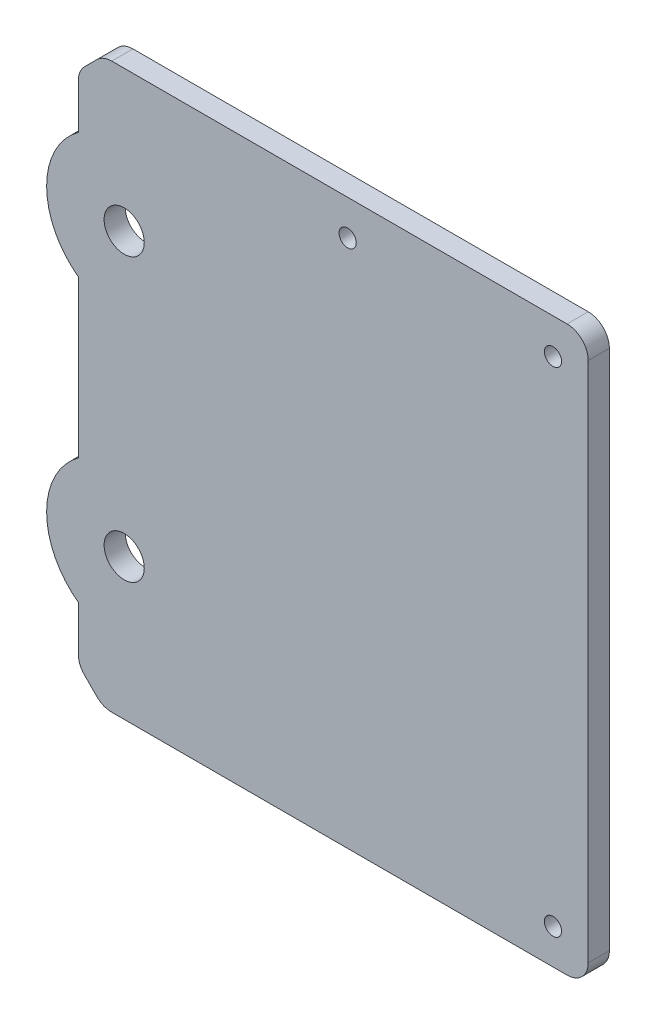
ISO-10303-21;
HEADER;
FILE_DESCRIPTION(('STEP AP214'),'2;1');
FILE_NAME('part.step','',(''),(''),'','','');
FILE_SCHEMA(('AUTOMOTIVE_DESIGN { 1 0 10303 214 1 1 1 1 }'));
ENDSEC;
DATA;
#1=APPLICATION_CONTEXT('core data for automotive mechanical design processes');
#2=APPLICATION_PROTOCOL_DEFINITION('international standard','automotive_design',2000,#1);
#3=PRODUCT_CONTEXT('',#1,'mechanical');
#4=PRODUCT('Part','Part','',(#3));
#5=PRODUCT_RELATED_PRODUCT_CATEGORY('part','',(#4));
#6=PRODUCT_DEFINITION_FORMATION('','',#4);
#7=PRODUCT_DEFINITION_CONTEXT('part definition',#1,'design');
#8=PRODUCT_DEFINITION('design','',#6,#7);
#9=PRODUCT_DEFINITION_SHAPE('','',#8);
#10=(LENGTH_UNIT() NAMED_UNIT(*) SI_UNIT(.MILLI.,.METRE.));
#11=(NAMED_UNIT(*) PLANE_ANGLE_UNIT() SI_UNIT($,.RADIAN.));
#12=(NAMED_UNIT(*) SI_UNIT($,.STERADIAN.) SOLID_ANGLE_UNIT());
#13=UNCERTAINTY_MEASURE_WITH_UNIT(LENGTH_MEASURE(1.E-05),#10,'distance_accuracy_value','');
#14=(GEOMETRIC_REPRESENTATION_CONTEXT(3) GLOBAL_UNCERTAINTY_ASSIGNED_CONTEXT((#13)) GLOBAL_UNIT_ASSIGNED_CONTEXT((#10,
#11,#12)) REPRESENTATION_CONTEXT('',''));
#15=CARTESIAN_POINT('',(0.,0.,0.));
#16=DIRECTION('',(0.,0.,1.));
#17=DIRECTION('',(1.,0.,0.));
#18=AXIS2_PLACEMENT_3D('',#15,#16,#17);
#19=CARTESIAN_POINT('',(-29.105845183392,0.,3.));
#20=DIRECTION('',(1.,0.,0.));
#21=DIRECTION('',(0.,0.,-1.));
#22=AXIS2_PLACEMENT_3D('',#19,#20,#21);
#23=PLANE('',#22);
#24=DIRECTION('',(0.,-1.,0.));
#25=VECTOR('',#24,1.);
#26=CARTESIAN_POINT('',(-29.105845183392,0.,0.));
#27=LINE('',#26,#25);
#28=CARTESIAN_POINT('',(-29.105845183392,11.1258803253506,0.));
#29=VERTEX_POINT('',#28);
#30=CARTESIAN_POINT('',(-29.105845183392,-11.1258803253506,0.));
#31=VERTEX_POINT('',#30);
#32=EDGE_CURVE('E159',#29,#31,#27,.T.);
#33=ORIENTED_EDGE('',*,*,#32,.T.);
#34=DIRECTION('',(0.,0.,1.));
#35=VECTOR('',#34,1.);
#36=CARTESIAN_POINT('',(-29.105845183392,-11.1258803253506,-18.3098334236006));
#37=LINE('',#36,#35);
#38=CARTESIAN_POINT('',(-29.105845183392,-11.1258803253506,3.));
#39=VERTEX_POINT('',#38);
#40=EDGE_CURVE('E60',#31,#39,#37,.T.);
#41=ORIENTED_EDGE('',*,*,#40,.T.);
#42=DIRECTION('',(0.,-1.,0.));
#43=VECTOR('',#42,1.);
#44=CARTESIAN_POINT('',(-29.105845183392,0.,3.));
#45=LINE('',#44,#43);
#46=CARTESIAN_POINT('',(-29.105845183392,11.1258803253506,3.));
#47=VERTEX_POINT('',#46);
#48=EDGE_CURVE('E224',#47,#39,#45,.T.);
#49=ORIENTED_EDGE('',*,*,#48,.F.);
#50=DIRECTION('',(0.,0.,1.));
#51=VECTOR('',#50,1.);
#52=CARTESIAN_POINT('',(-29.105845183392,11.1258803253506,-18.3098334236006));
#53=LINE('',#52,#51);
#54=EDGE_CURVE('E174',#29,#47,#53,.T.);
#55=ORIENTED_EDGE('',*,*,#54,.F.);
#56=EDGE_LOOP('',(#33,#41,#49,#55));
#57=FACE_BOUND('',#56,.T.);
#58=ADVANCED_FACE('F37',(#57),#23,.F.);
#59=CARTESIAN_POINT('',(-29.105845183392,35.2573593128807,0.));
#60=VERTEX_POINT('',#59);
#61=CARTESIAN_POINT('',(-29.105845183392,28.8741196746494,0.));
#62=VERTEX_POINT('',#61);
#63=EDGE_CURVE('E162',#60,#62,#27,.T.);
#64=ORIENTED_EDGE('',*,*,#63,.T.);
#65=DIRECTION('',(0.,0.,1.));
#66=VECTOR('',#65,1.);
#67=CARTESIAN_POINT('',(-29.105845183392,28.8741196746494,-18.3098334236006));
#68=LINE('',#67,#66);
#69=CARTESIAN_POINT('',(-29.105845183392,28.8741196746494,3.));
#70=VERTEX_POINT('',#69);
#71=EDGE_CURVE('E182',#62,#70,#68,.T.);
#72=ORIENTED_EDGE('',*,*,#71,.T.);
#73=CARTESIAN_POINT('',(-29.105845183392,35.2573593128807,3.));
#74=VERTEX_POINT('',#73);
#75=EDGE_CURVE('E220',#74,#70,#45,.T.);
#76=ORIENTED_EDGE('',*,*,#75,.F.);
#77=DIRECTION('',(0.,0.,-1.));
#78=VECTOR('',#77,1.);
#79=CARTESIAN_POINT('',(-29.105845183392,35.2573593128807,0.));
#80=LINE('',#79,#78);
#81=EDGE_CURVE('E279',#74,#60,#80,.T.);
#82=ORIENTED_EDGE('',*,*,#81,.T.);
#83=EDGE_LOOP('',(#64,#72,#76,#82));
#84=FACE_BOUND('',#83,.T.);
#85=ADVANCED_FACE('F345',(#84),#23,.F.);
#86=CARTESIAN_POINT('',(0.,40.,3.));
#87=DIRECTION('',(0.,1.,0.));
#88=DIRECTION('',(0.,0.,1.));
#89=AXIS2_PLACEMENT_3D('',#86,#87,#88);
#90=PLANE('',#89);
#91=DIRECTION('',(1.,0.,0.));
#92=VECTOR('',#91,1.);
#93=CARTESIAN_POINT('',(0.,40.,0.));
#94=LINE('',#93,#92);
#95=CARTESIAN_POINT('',(-24.3632044962727,40.,0.));
#96=VERTEX_POINT('',#95);
#97=CARTESIAN_POINT('',(40.224154816608,40.,0.));
#98=VERTEX_POINT('',#97);
#99=EDGE_CURVE('E160',#96,#98,#94,.T.);
#100=ORIENTED_EDGE('',*,*,#99,.F.);
#101=DIRECTION('',(0.,0.,1.));
#102=VECTOR('',#101,1.);
#103=CARTESIAN_POINT('',(-24.3632044962727,40.,3.));
#104=LINE('',#103,#102);
#105=CARTESIAN_POINT('',(-24.3632044962727,40.,3.));
#106=VERTEX_POINT('',#105);
#107=EDGE_CURVE('E291',#96,#106,#104,.T.);
#108=ORIENTED_EDGE('',*,*,#107,.T.);
#109=DIRECTION('',(1.,0.,0.));
#110=VECTOR('',#109,1.);
#111=CARTESIAN_POINT('',(0.,40.,3.));
#112=LINE('',#111,#110);
#113=CARTESIAN_POINT('',(40.224154816608,40.,3.));
#114=VERTEX_POINT('',#113);
#115=EDGE_CURVE('E216',#106,#114,#112,.T.);
#116=ORIENTED_EDGE('',*,*,#115,.T.);
#117=DIRECTION('',(0.,0.,-1.));
#118=VECTOR('',#117,1.);
#119=CARTESIAN_POINT('',(40.224154816608,40.,3.));
#120=LINE('',#119,#118);
#121=EDGE_CURVE('E288',#114,#98,#120,.T.);
#122=ORIENTED_EDGE('',*,*,#121,.T.);
#123=EDGE_LOOP('',(#100,#108,#116,#122));
#124=FACE_BOUND('',#123,.T.);
#125=ADVANCED_FACE('F309',(#124),#90,.T.);
#126=CARTESIAN_POINT('',(-29.105845183392,-28.8741196746494,3.));
#127=VERTEX_POINT('',#126);
#128=CARTESIAN_POINT('',(-29.105845183392,-35.2573593128807,3.));
#129=VERTEX_POINT('',#128);
#130=EDGE_CURVE('E52',#127,#129,#45,.T.);
#131=ORIENTED_EDGE('',*,*,#130,.F.);
#132=DIRECTION('',(0.,0.,1.));
#133=VECTOR('',#132,1.);
#134=CARTESIAN_POINT('',(-29.105845183392,-28.8741196746494,-18.3098334236006));
#135=LINE('',#134,#133);
#136=CARTESIAN_POINT('',(-29.105845183392,-28.8741196746494,0.));
#137=VERTEX_POINT('',#136);
#138=EDGE_CURVE('E163',#137,#127,#135,.T.);
#139=ORIENTED_EDGE('',*,*,#138,.F.);
#140=CARTESIAN_POINT('',(-29.105845183392,-35.2573593128807,0.));
#141=VERTEX_POINT('',#140);
#142=EDGE_CURVE('E150',#137,#141,#27,.T.);
#143=ORIENTED_EDGE('',*,*,#142,.T.);
#144=DIRECTION('',(0.,0.,1.));
#145=VECTOR('',#144,1.);
#146=CARTESIAN_POINT('',(-29.105845183392,-35.2573593128807,3.));
#147=LINE('',#146,#145);
#148=EDGE_CURVE('E282',#141,#129,#147,.T.);
#149=ORIENTED_EDGE('',*,*,#148,.T.);
#150=EDGE_LOOP('',(#131,#139,#143,#149));
#151=FACE_BOUND('',#150,.T.);
#152=ADVANCED_FACE('F164',(#151),#23,.F.);
#153=CARTESIAN_POINT('',(0.,-40.,3.));
#154=DIRECTION('',(0.,-1.,0.));
#155=DIRECTION('',(0.,0.,-1.));
#156=AXIS2_PLACEMENT_3D('',#153,#154,#155);
#157=PLANE('',#156);
#158=DIRECTION('',(-1.,0.,0.));
#159=VECTOR('',#158,1.);
#160=CARTESIAN_POINT('',(0.,-40.,3.));
#161=LINE('',#160,#159);
#162=CARTESIAN_POINT('',(40.224154816608,-40.,3.));
#163=VERTEX_POINT('',#162);
#164=CARTESIAN_POINT('',(-24.3632044962727,-40.,3.));
#165=VERTEX_POINT('',#164);
#166=EDGE_CURVE('E223',#163,#165,#161,.T.);
#167=ORIENTED_EDGE('',*,*,#166,.T.);
#168=DIRECTION('',(0.,0.,-1.));
#169=VECTOR('',#168,1.);
#170=CARTESIAN_POINT('',(-24.3632044962727,-40.,3.));
#171=LINE('',#170,#169);
#172=CARTESIAN_POINT('',(-24.3632044962727,-40.,0.));
#173=VERTEX_POINT('',#172);
#174=EDGE_CURVE('E249',#165,#173,#171,.T.);
#175=ORIENTED_EDGE('',*,*,#174,.T.);
#176=DIRECTION('',(-1.,0.,0.));
#177=VECTOR('',#176,1.);
#178=CARTESIAN_POINT('',(0.,-40.,0.));
#179=LINE('',#178,#177);
#180=CARTESIAN_POINT('',(40.224154816608,-40.,0.));
#181=VERTEX_POINT('',#180);
#182=EDGE_CURVE('E233',#181,#173,#179,.T.);
#183=ORIENTED_EDGE('',*,*,#182,.F.);
#184=DIRECTION('',(0.,0.,-1.));
#185=VECTOR('',#184,1.);
#186=CARTESIAN_POINT('',(40.224154816608,-40.,3.));
#187=LINE('',#186,#185);
#188=EDGE_CURVE('E247',#181,#163,#187,.F.);
#189=ORIENTED_EDGE('',*,*,#188,.T.);
#190=EDGE_LOOP('',(#167,#175,#183,#189));
#191=FACE_BOUND('',#190,.T.);
#192=ADVANCED_FACE('F318',(#191),#157,.T.);
#193=CARTESIAN_POINT('',(43.224154816608,0.,3.));
#194=DIRECTION('',(1.,0.,0.));
#195=DIRECTION('',(0.,0.,-1.));
#196=AXIS2_PLACEMENT_3D('',#193,#194,#195);
#197=PLANE('',#196);
#198=DIRECTION('',(0.,-1.,0.));
#199=VECTOR('',#198,1.);
#200=CARTESIAN_POINT('',(43.224154816608,0.,0.));
#201=LINE('',#200,#199);
#202=CARTESIAN_POINT('',(43.224154816608,37.,0.));
#203=VERTEX_POINT('',#202);
#204=CARTESIAN_POINT('',(43.224154816608,-37.,0.));
#205=VERTEX_POINT('',#204);
#206=EDGE_CURVE('E219',#203,#205,#201,.T.);
#207=ORIENTED_EDGE('',*,*,#206,.F.);
#208=DIRECTION('',(0.,0.,-1.));
#209=VECTOR('',#208,1.);
#210=CARTESIAN_POINT('',(43.224154816608,37.,3.));
#211=LINE('',#210,#209);
#212=CARTESIAN_POINT('',(43.224154816608,37.,3.));
#213=VERTEX_POINT('',#212);
#214=EDGE_CURVE('E11',#203,#213,#211,.F.);
#215=ORIENTED_EDGE('',*,*,#214,.T.);
#216=DIRECTION('',(0.,-1.,0.));
#217=VECTOR('',#216,1.);
#218=CARTESIAN_POINT('',(43.224154816608,0.,3.));
#219=LINE('',#218,#217);
#220=CARTESIAN_POINT('',(43.224154816608,-37.,3.));
#221=VERTEX_POINT('',#220);
#222=EDGE_CURVE('E227',#213,#221,#219,.T.);
#223=ORIENTED_EDGE('',*,*,#222,.T.);
#224=DIRECTION('',(0.,0.,-1.));
#225=VECTOR('',#224,1.);
#226=CARTESIAN_POINT('',(43.224154816608,-37.,3.));
#227=LINE('',#226,#225);
#228=EDGE_CURVE('E45',#221,#205,#227,.T.);
#229=ORIENTED_EDGE('',*,*,#228,.T.);
#230=EDGE_LOOP('',(#207,#215,#223,#229));
#231=FACE_BOUND('',#230,.T.);
#232=ADVANCED_FACE('F297',(#231),#197,.T.);
#233=CARTESIAN_POINT('',(0.,0.,3.));
#234=DIRECTION('',(0.,0.,1.));
#235=DIRECTION('',(1.,0.,0.));
#236=AXIS2_PLACEMENT_3D('',#233,#234,#235);
#237=PLANE('',#236);
#238=CARTESIAN_POINT('',(9.09915481660799,35.,3.));
#239=DIRECTION('',(0.,0.,1.));
#240=DIRECTION('',(1.,0.,0.));
#241=AXIS2_PLACEMENT_3D('',#238,#239,#240);
#242=CIRCLE('',#241,1.2192);
#243=CARTESIAN_POINT('',(10.318354816608,35.,3.));
#244=VERTEX_POINT('',#243);
#245=EDGE_CURVE('E181',#244,#244,#242,.T.);
#246=ORIENTED_EDGE('',*,*,#245,.F.);
#247=EDGE_LOOP('',(#246));
#248=FACE_BOUND('',#247,.T.);
#249=CARTESIAN_POINT('',(38.224154816608,35.,3.));
#250=DIRECTION('',(0.,0.,1.));
#251=DIRECTION('',(1.,0.,0.));
#252=AXIS2_PLACEMENT_3D('',#249,#250,#251);
#253=CIRCLE('',#252,1.2192);
#254=CARTESIAN_POINT('',(39.443354816608,35.,3.));
#255=VERTEX_POINT('',#254);
#256=EDGE_CURVE('E192',#255,#255,#253,.T.);
#257=ORIENTED_EDGE('',*,*,#256,.F.);
#258=EDGE_LOOP('',(#257));
#259=FACE_BOUND('',#258,.T.);
#260=CARTESIAN_POINT('',(38.224154816608,-35.,3.));
#261=DIRECTION('',(0.,0.,1.));
#262=DIRECTION('',(1.,0.,0.));
#263=AXIS2_PLACEMENT_3D('',#260,#261,#262);
#264=CIRCLE('',#263,1.2192);
#265=CARTESIAN_POINT('',(39.443354816608,-35.,3.));
#266=VERTEX_POINT('',#265);
#267=EDGE_CURVE('E198',#266,#266,#264,.T.);
#268=ORIENTED_EDGE('',*,*,#267,.F.);
#269=EDGE_LOOP('',(#268));
#270=FACE_BOUND('',#269,.T.);
#271=CARTESIAN_POINT('',(-22.605845183392,-20.,3.));
#272=DIRECTION('',(0.,0.,1.));
#273=DIRECTION('',(1.,0.,0.));
#274=AXIS2_PLACEMENT_3D('',#271,#272,#273);
#275=CIRCLE('',#274,2.85);
#276=CARTESIAN_POINT('',(-19.755845183392,-20.,3.));
#277=VERTEX_POINT('',#276);
#278=EDGE_CURVE('E204',#277,#277,#275,.T.);
#279=ORIENTED_EDGE('',*,*,#278,.F.);
#280=EDGE_LOOP('',(#279));
#281=FACE_BOUND('',#280,.T.);
#282=CARTESIAN_POINT('',(-22.605845183392,20.,3.));
#283=DIRECTION('',(0.,0.,1.));
#284=DIRECTION('',(1.,0.,0.));
#285=AXIS2_PLACEMENT_3D('',#282,#283,#284);
#286=CIRCLE('',#285,2.85);
#287=CARTESIAN_POINT('',(-19.755845183392,20.,3.));
#288=VERTEX_POINT('',#287);
#289=EDGE_CURVE('E210',#288,#288,#286,.T.);
#290=ORIENTED_EDGE('',*,*,#289,.F.);
#291=EDGE_LOOP('',(#290));
#292=FACE_BOUND('',#291,.T.);
#293=DIRECTION('',(0.707106781186546,-0.707106781186549,0.));
#294=VECTOR('',#293,1.);
#295=CARTESIAN_POINT('',(-32.802922591696,-32.8029225916959,3.));
#296=LINE('',#295,#294);
#297=CARTESIAN_POINT('',(-28.2271655269516,-37.3786796564403,3.));
#298=VERTEX_POINT('',#297);
#299=CARTESIAN_POINT('',(-26.4845248398323,-39.1213203435596,3.));
#300=VERTEX_POINT('',#299);
#301=EDGE_CURVE('E244',#298,#300,#296,.T.);
#302=ORIENTED_EDGE('',*,*,#301,.T.);
#303=CARTESIAN_POINT('',(-24.3632044962727,-37.,3.));
#304=DIRECTION('',(0.,0.,1.));
#305=DIRECTION('',(1.,0.,0.));
#306=AXIS2_PLACEMENT_3D('',#303,#304,#305);
#307=CIRCLE('',#306,3.);
#308=EDGE_CURVE('E277',#300,#165,#307,.T.);
#309=ORIENTED_EDGE('',*,*,#308,.T.);
#310=ORIENTED_EDGE('',*,*,#166,.F.);
#311=CARTESIAN_POINT('',(40.224154816608,-37.,3.));
#312=DIRECTION('',(0.,0.,1.));
#313=DIRECTION('',(1.,0.,0.));
#314=AXIS2_PLACEMENT_3D('',#311,#312,#313);
#315=CIRCLE('',#314,3.);
#316=EDGE_CURVE('E267',#163,#221,#315,.T.);
#317=ORIENTED_EDGE('',*,*,#316,.T.);
#318=ORIENTED_EDGE('',*,*,#222,.F.);
#319=CARTESIAN_POINT('',(40.224154816608,37.,3.));
#320=DIRECTION('',(0.,0.,1.));
#321=DIRECTION('',(1.,0.,0.));
#322=AXIS2_PLACEMENT_3D('',#319,#320,#321);
#323=CIRCLE('',#322,3.);
#324=EDGE_CURVE('E269',#213,#114,#323,.T.);
#325=ORIENTED_EDGE('',*,*,#324,.T.);
#326=ORIENTED_EDGE('',*,*,#115,.F.);
#327=CARTESIAN_POINT('',(-24.3632044962727,37.,3.));
#328=DIRECTION('',(0.,0.,1.));
#329=DIRECTION('',(1.,0.,0.));
#330=AXIS2_PLACEMENT_3D('',#327,#328,#329);
#331=CIRCLE('',#330,3.);
#332=CARTESIAN_POINT('',(-26.4845248398323,39.1213203435596,3.));
#333=VERTEX_POINT('',#332);
#334=EDGE_CURVE('E271',#106,#333,#331,.T.);
#335=ORIENTED_EDGE('',*,*,#334,.T.);
#336=DIRECTION('',(-0.707106781186549,-0.707106781186546,0.));
#337=VECTOR('',#336,1.);
#338=CARTESIAN_POINT('',(-32.8029225916959,32.8029225916961,3.));
#339=LINE('',#338,#337);
#340=CARTESIAN_POINT('',(-28.2271655269516,37.3786796564403,3.));
#341=VERTEX_POINT('',#340);
#342=EDGE_CURVE('E241',#333,#341,#339,.T.);
#343=ORIENTED_EDGE('',*,*,#342,.T.);
#344=CARTESIAN_POINT('',(-26.105845183392,35.2573593128807,3.));
#345=DIRECTION('',(0.,0.,1.));
#346=DIRECTION('',(1.,0.,0.));
#347=AXIS2_PLACEMENT_3D('',#344,#345,#346);
#348=CIRCLE('',#347,3.);
#349=EDGE_CURVE('E273',#341,#74,#348,.T.);
#350=ORIENTED_EDGE('',*,*,#349,.T.);
#351=ORIENTED_EDGE('',*,*,#75,.T.);
#352=CARTESIAN_POINT('',(-22.605845183392,20.,3.));
#353=DIRECTION('',(0.,0.,1.));
#354=DIRECTION('',(1.,0.,0.));
#355=AXIS2_PLACEMENT_3D('',#352,#353,#354);
#356=CIRCLE('',#355,11.);
#357=EDGE_CURVE('E171',#70,#47,#356,.T.);
#358=ORIENTED_EDGE('',*,*,#357,.T.);
#359=ORIENTED_EDGE('',*,*,#48,.T.);
#360=CARTESIAN_POINT('',(-22.605845183392,-20.,3.));
#361=DIRECTION('',(0.,0.,1.));
#362=DIRECTION('',(1.,0.,0.));
#363=AXIS2_PLACEMENT_3D('',#360,#361,#362);
#364=CIRCLE('',#363,11.);
#365=EDGE_CURVE('E168',#39,#127,#364,.T.);
#366=ORIENTED_EDGE('',*,*,#365,.T.);
#367=ORIENTED_EDGE('',*,*,#130,.T.);
#368=CARTESIAN_POINT('',(-26.105845183392,-35.2573593128807,3.));
#369=DIRECTION('',(0.,0.,1.));
#370=DIRECTION('',(1.,0.,0.));
#371=AXIS2_PLACEMENT_3D('',#368,#369,#370);
#372=CIRCLE('',#371,3.);
#373=EDGE_CURVE('E275',#129,#298,#372,.T.);
#374=ORIENTED_EDGE('',*,*,#373,.T.);
#375=EDGE_LOOP('',(#302,#309,#310,#317,#318,#325,#326,#335,#343,#350,#351,#358,#359,#366,#367,#374));
#376=FACE_BOUND('',#375,.T.);
#377=ADVANCED_FACE('F313',(#248,#259,#270,#281,#292,#376),#237,.T.);
#378=CARTESIAN_POINT('',(0.,0.,0.));
#379=DIRECTION('',(0.,0.,1.));
#380=DIRECTION('',(1.,0.,0.));
#381=AXIS2_PLACEMENT_3D('',#378,#379,#380);
#382=PLANE('',#381);
#383=CARTESIAN_POINT('',(9.09915481660799,35.,0.));
#384=DIRECTION('',(0.,0.,1.));
#385=DIRECTION('',(1.,0.,0.));
#386=AXIS2_PLACEMENT_3D('',#383,#384,#385);
#387=CIRCLE('',#386,1.2192);
#388=CARTESIAN_POINT('',(10.318354816608,35.,0.));
#389=VERTEX_POINT('',#388);
#390=EDGE_CURVE('E189',#389,#389,#387,.T.);
#391=ORIENTED_EDGE('',*,*,#390,.T.);
#392=EDGE_LOOP('',(#391));
#393=FACE_BOUND('',#392,.T.);
#394=CARTESIAN_POINT('',(38.224154816608,35.,0.));
#395=DIRECTION('',(0.,0.,1.));
#396=DIRECTION('',(1.,0.,0.));
#397=AXIS2_PLACEMENT_3D('',#394,#395,#396);
#398=CIRCLE('',#397,1.2192);
#399=CARTESIAN_POINT('',(39.443354816608,35.,0.));
#400=VERTEX_POINT('',#399);
#401=EDGE_CURVE('E195',#400,#400,#398,.T.);
#402=ORIENTED_EDGE('',*,*,#401,.T.);
#403=EDGE_LOOP('',(#402));
#404=FACE_BOUND('',#403,.T.);
#405=CARTESIAN_POINT('',(38.224154816608,-35.,0.));
#406=DIRECTION('',(0.,0.,1.));
#407=DIRECTION('',(1.,0.,0.));
#408=AXIS2_PLACEMENT_3D('',#405,#406,#407);
#409=CIRCLE('',#408,1.2192);
#410=CARTESIAN_POINT('',(39.443354816608,-35.,0.));
#411=VERTEX_POINT('',#410);
#412=EDGE_CURVE('E201',#411,#411,#409,.T.);
#413=ORIENTED_EDGE('',*,*,#412,.T.);
#414=EDGE_LOOP('',(#413));
#415=FACE_BOUND('',#414,.T.);
#416=CARTESIAN_POINT('',(-22.605845183392,-20.,0.));
#417=DIRECTION('',(0.,0.,1.));
#418=DIRECTION('',(1.,0.,0.));
#419=AXIS2_PLACEMENT_3D('',#416,#417,#418);
#420=CIRCLE('',#419,2.85);
#421=CARTESIAN_POINT('',(-19.755845183392,-20.,0.));
#422=VERTEX_POINT('',#421);
#423=EDGE_CURVE('E207',#422,#422,#420,.T.);
#424=ORIENTED_EDGE('',*,*,#423,.T.);
#425=EDGE_LOOP('',(#424));
#426=FACE_BOUND('',#425,.T.);
#427=CARTESIAN_POINT('',(-22.605845183392,20.,0.));
#428=DIRECTION('',(0.,0.,1.));
#429=DIRECTION('',(1.,0.,0.));
#430=AXIS2_PLACEMENT_3D('',#427,#428,#429);
#431=CIRCLE('',#430,2.85);
#432=CARTESIAN_POINT('',(-19.755845183392,20.,0.));
#433=VERTEX_POINT('',#432);
#434=EDGE_CURVE('E213',#433,#433,#431,.T.);
#435=ORIENTED_EDGE('',*,*,#434,.T.);
#436=EDGE_LOOP('',(#435));
#437=FACE_BOUND('',#436,.T.);
#438=ORIENTED_EDGE('',*,*,#182,.T.);
#439=CARTESIAN_POINT('',(-24.3632044962727,-37.,0.));
#440=DIRECTION('',(0.,0.,1.));
#441=DIRECTION('',(1.,0.,0.));
#442=AXIS2_PLACEMENT_3D('',#439,#440,#441);
#443=CIRCLE('',#442,3.);
#444=CARTESIAN_POINT('',(-26.4845248398323,-39.1213203435596,0.));
#445=VERTEX_POINT('',#444);
#446=EDGE_CURVE('E261',#173,#445,#443,.F.);
#447=ORIENTED_EDGE('',*,*,#446,.T.);
#448=DIRECTION('',(-0.707106781186546,0.707106781186549,0.));
#449=VECTOR('',#448,1.);
#450=CARTESIAN_POINT('',(-25.605845183392,-40.,0.));
#451=LINE('',#450,#449);
#452=CARTESIAN_POINT('',(-28.2271655269516,-37.3786796564403,0.));
#453=VERTEX_POINT('',#452);
#454=EDGE_CURVE('E239',#445,#453,#451,.T.);
#455=ORIENTED_EDGE('',*,*,#454,.T.);
#456=CARTESIAN_POINT('',(-26.105845183392,-35.2573593128807,0.));
#457=DIRECTION('',(0.,0.,1.));
#458=DIRECTION('',(1.,0.,0.));
#459=AXIS2_PLACEMENT_3D('',#456,#457,#458);
#460=CIRCLE('',#459,3.);
#461=EDGE_CURVE('E157',#453,#141,#460,.F.);
#462=ORIENTED_EDGE('',*,*,#461,.T.);
#463=ORIENTED_EDGE('',*,*,#142,.F.);
#464=CARTESIAN_POINT('',(-22.605845183392,-20.,0.));
#465=DIRECTION('',(0.,0.,1.));
#466=DIRECTION('',(1.,0.,0.));
#467=AXIS2_PLACEMENT_3D('',#464,#465,#466);
#468=CIRCLE('',#467,11.);
#469=EDGE_CURVE('E154',#137,#31,#468,.F.);
#470=ORIENTED_EDGE('',*,*,#469,.T.);
#471=ORIENTED_EDGE('',*,*,#32,.F.);
#472=CARTESIAN_POINT('',(-22.605845183392,20.,0.));
#473=DIRECTION('',(0.,0.,1.));
#474=DIRECTION('',(1.,0.,0.));
#475=AXIS2_PLACEMENT_3D('',#472,#473,#474);
#476=CIRCLE('',#475,11.);
#477=EDGE_CURVE('E179',#29,#62,#476,.F.);
#478=ORIENTED_EDGE('',*,*,#477,.T.);
#479=ORIENTED_EDGE('',*,*,#63,.F.);
#480=CARTESIAN_POINT('',(-26.105845183392,35.2573593128807,0.));
#481=DIRECTION('',(0.,0.,1.));
#482=DIRECTION('',(1.,0.,0.));
#483=AXIS2_PLACEMENT_3D('',#480,#481,#482);
#484=CIRCLE('',#483,3.);
#485=CARTESIAN_POINT('',(-28.2271655269516,37.3786796564403,0.));
#486=VERTEX_POINT('',#485);
#487=EDGE_CURVE('E258',#60,#486,#484,.F.);
#488=ORIENTED_EDGE('',*,*,#487,.T.);
#489=DIRECTION('',(0.707106781186549,0.707106781186546,0.));
#490=VECTOR('',#489,1.);
#491=CARTESIAN_POINT('',(-29.105845183392,36.5,0.));
#492=LINE('',#491,#490);
#493=CARTESIAN_POINT('',(-26.4845248398323,39.1213203435596,0.));
#494=VERTEX_POINT('',#493);
#495=EDGE_CURVE('E230',#486,#494,#492,.T.);
#496=ORIENTED_EDGE('',*,*,#495,.T.);
#497=CARTESIAN_POINT('',(-24.3632044962727,37.,0.));
#498=DIRECTION('',(0.,0.,1.));
#499=DIRECTION('',(1.,0.,0.));
#500=AXIS2_PLACEMENT_3D('',#497,#498,#499);
#501=CIRCLE('',#500,3.);
#502=EDGE_CURVE('E256',#494,#96,#501,.F.);
#503=ORIENTED_EDGE('',*,*,#502,.T.);
#504=ORIENTED_EDGE('',*,*,#99,.T.);
#505=CARTESIAN_POINT('',(40.224154816608,37.,0.));
#506=DIRECTION('',(0.,0.,1.));
#507=DIRECTION('',(1.,0.,0.));
#508=AXIS2_PLACEMENT_3D('',#505,#506,#507);
#509=CIRCLE('',#508,3.);
#510=EDGE_CURVE('E254',#98,#203,#509,.F.);
#511=ORIENTED_EDGE('',*,*,#510,.T.);
#512=ORIENTED_EDGE('',*,*,#206,.T.);
#513=CARTESIAN_POINT('',(40.224154816608,-37.,0.));
#514=DIRECTION('',(0.,0.,1.));
#515=DIRECTION('',(1.,0.,0.));
#516=AXIS2_PLACEMENT_3D('',#513,#514,#515);
#517=CIRCLE('',#516,3.);
#518=EDGE_CURVE('E252',#205,#181,#517,.F.);
#519=ORIENTED_EDGE('',*,*,#518,.T.);
#520=EDGE_LOOP('',(#438,#447,#455,#462,#463,#470,#471,#478,#479,#488,#496,#503,#504,#511,#512,#519));
#521=FACE_BOUND('',#520,.T.);
#522=ADVANCED_FACE('F152',(#393,#404,#415,#426,#437,#521),#382,.F.);
#523=CARTESIAN_POINT('',(-22.605845183392,20.,3.));
#524=DIRECTION('',(0.,0.,1.));
#525=DIRECTION('',(1.,0.,0.));
#526=AXIS2_PLACEMENT_3D('',#523,#524,#525);
#527=CYLINDRICAL_SURFACE('',#526,2.85);
#528=ORIENTED_EDGE('',*,*,#434,.F.);
#529=EDGE_LOOP('',(#528));
#530=FACE_BOUND('',#529,.T.);
#531=ORIENTED_EDGE('',*,*,#289,.T.);
#532=EDGE_LOOP('',(#531));
#533=FACE_BOUND('',#532,.T.);
#534=ADVANCED_FACE('F403',(#530,#533),#527,.F.);
#535=CARTESIAN_POINT('',(-22.605845183392,-20.,3.));
#536=DIRECTION('',(0.,0.,1.));
#537=DIRECTION('',(1.,0.,0.));
#538=AXIS2_PLACEMENT_3D('',#535,#536,#537);
#539=CYLINDRICAL_SURFACE('',#538,2.85);
#540=ORIENTED_EDGE('',*,*,#423,.F.);
#541=EDGE_LOOP('',(#540));
#542=FACE_BOUND('',#541,.T.);
#543=ORIENTED_EDGE('',*,*,#278,.T.);
#544=EDGE_LOOP('',(#543));
#545=FACE_BOUND('',#544,.T.);
#546=ADVANCED_FACE('F363',(#542,#545),#539,.F.);
#547=CARTESIAN_POINT('',(-25.605845183392,-40.,3.));
#548=DIRECTION('',(-0.707106781186549,-0.707106781186546,0.));
#549=DIRECTION('',(0.,0.,1.));
#550=AXIS2_PLACEMENT_3D('',#547,#548,#549);
#551=PLANE('',#550);
#552=ORIENTED_EDGE('',*,*,#454,.F.);
#553=DIRECTION('',(0.,0.,-1.));
#554=VECTOR('',#553,1.);
#555=CARTESIAN_POINT('',(-26.4845248398323,-39.1213203435596,3.));
#556=LINE('',#555,#554);
#557=EDGE_CURVE('E265',#445,#300,#556,.F.);
#558=ORIENTED_EDGE('',*,*,#557,.T.);
#559=ORIENTED_EDGE('',*,*,#301,.F.);
#560=DIRECTION('',(0.,0.,1.));
#561=VECTOR('',#560,1.);
#562=CARTESIAN_POINT('',(-28.2271655269516,-37.3786796564403,0.));
#563=LINE('',#562,#561);
#564=EDGE_CURVE('E263',#298,#453,#563,.F.);
#565=ORIENTED_EDGE('',*,*,#564,.T.);
#566=EDGE_LOOP('',(#552,#558,#559,#565));
#567=FACE_BOUND('',#566,.T.);
#568=ADVANCED_FACE('F324',(#567),#551,.T.);
#569=CARTESIAN_POINT('',(-29.105845183392,36.5,3.));
#570=DIRECTION('',(-0.707106781186546,0.707106781186549,0.));
#571=DIRECTION('',(0.,0.,1.));
#572=AXIS2_PLACEMENT_3D('',#569,#570,#571);
#573=PLANE('',#572);
#574=ORIENTED_EDGE('',*,*,#495,.F.);
#575=DIRECTION('',(0.,0.,-1.));
#576=VECTOR('',#575,1.);
#577=CARTESIAN_POINT('',(-28.2271655269516,37.3786796564403,3.));
#578=LINE('',#577,#576);
#579=EDGE_CURVE('E286',#486,#341,#578,.F.);
#580=ORIENTED_EDGE('',*,*,#579,.T.);
#581=ORIENTED_EDGE('',*,*,#342,.F.);
#582=DIRECTION('',(0.,0.,1.));
#583=VECTOR('',#582,1.);
#584=CARTESIAN_POINT('',(-26.4845248398323,39.1213203435596,3.));
#585=LINE('',#584,#583);
#586=EDGE_CURVE('E284',#333,#494,#585,.F.);
#587=ORIENTED_EDGE('',*,*,#586,.T.);
#588=EDGE_LOOP('',(#574,#580,#581,#587));
#589=FACE_BOUND('',#588,.T.);
#590=ADVANCED_FACE('F342',(#589),#573,.T.);
#591=CARTESIAN_POINT('',(-24.3632044962727,-37.,3.));
#592=DIRECTION('',(0.,0.,-1.));
#593=DIRECTION('',(-1.,0.,0.));
#594=AXIS2_PLACEMENT_3D('',#591,#592,#593);
#595=CYLINDRICAL_SURFACE('',#594,3.);
#596=ORIENTED_EDGE('',*,*,#308,.F.);
#597=ORIENTED_EDGE('',*,*,#557,.F.);
#598=ORIENTED_EDGE('',*,*,#446,.F.);
#599=ORIENTED_EDGE('',*,*,#174,.F.);
#600=EDGE_LOOP('',(#596,#597,#598,#599));
#601=FACE_BOUND('',#600,.T.);
#602=ADVANCED_FACE('F328',(#601),#595,.T.);
#603=CARTESIAN_POINT('',(-26.105845183392,-35.2573593128807,3.));
#604=DIRECTION('',(0.,0.,-1.));
#605=DIRECTION('',(-1.,0.,0.));
#606=AXIS2_PLACEMENT_3D('',#603,#604,#605);
#607=CYLINDRICAL_SURFACE('',#606,3.);
#608=ORIENTED_EDGE('',*,*,#461,.F.);
#609=ORIENTED_EDGE('',*,*,#564,.F.);
#610=ORIENTED_EDGE('',*,*,#373,.F.);
#611=ORIENTED_EDGE('',*,*,#148,.F.);
#612=EDGE_LOOP('',(#608,#609,#610,#611));
#613=FACE_BOUND('',#612,.T.);
#614=ADVANCED_FACE('F331',(#613),#607,.T.);
#615=CARTESIAN_POINT('',(-26.105845183392,35.2573593128807,3.));
#616=DIRECTION('',(0.,0.,1.));
#617=DIRECTION('',(1.,0.,0.));
#618=AXIS2_PLACEMENT_3D('',#615,#616,#617);
#619=CYLINDRICAL_SURFACE('',#618,3.);
#620=ORIENTED_EDGE('',*,*,#349,.F.);
#621=ORIENTED_EDGE('',*,*,#579,.F.);
#622=ORIENTED_EDGE('',*,*,#487,.F.);
#623=ORIENTED_EDGE('',*,*,#81,.F.);
#624=EDGE_LOOP('',(#620,#621,#622,#623));
#625=FACE_BOUND('',#624,.T.);
#626=ADVANCED_FACE('F333',(#625),#619,.T.);
#627=CARTESIAN_POINT('',(-24.3632044962727,37.,3.));
#628=DIRECTION('',(0.,0.,1.));
#629=DIRECTION('',(1.,0.,0.));
#630=AXIS2_PLACEMENT_3D('',#627,#628,#629);
#631=CYLINDRICAL_SURFACE('',#630,3.);
#632=ORIENTED_EDGE('',*,*,#502,.F.);
#633=ORIENTED_EDGE('',*,*,#586,.F.);
#634=ORIENTED_EDGE('',*,*,#334,.F.);
#635=ORIENTED_EDGE('',*,*,#107,.F.);
#636=EDGE_LOOP('',(#632,#633,#634,#635));
#637=FACE_BOUND('',#636,.T.);
#638=ADVANCED_FACE('F339',(#637),#631,.T.);
#639=CARTESIAN_POINT('',(40.224154816608,37.,3.));
#640=DIRECTION('',(0.,0.,-1.));
#641=DIRECTION('',(-1.,0.,0.));
#642=AXIS2_PLACEMENT_3D('',#639,#640,#641);
#643=CYLINDRICAL_SURFACE('',#642,3.);
#644=ORIENTED_EDGE('',*,*,#324,.F.);
#645=ORIENTED_EDGE('',*,*,#214,.F.);
#646=ORIENTED_EDGE('',*,*,#510,.F.);
#647=ORIENTED_EDGE('',*,*,#121,.F.);
#648=EDGE_LOOP('',(#644,#645,#646,#647));
#649=FACE_BOUND('',#648,.T.);
#650=ADVANCED_FACE('F307',(#649),#643,.T.);
#651=CARTESIAN_POINT('',(40.224154816608,-37.,3.));
#652=DIRECTION('',(0.,0.,-1.));
#653=DIRECTION('',(-1.,0.,0.));
#654=AXIS2_PLACEMENT_3D('',#651,#652,#653);
#655=CYLINDRICAL_SURFACE('',#654,3.);
#656=ORIENTED_EDGE('',*,*,#316,.F.);
#657=ORIENTED_EDGE('',*,*,#188,.F.);
#658=ORIENTED_EDGE('',*,*,#518,.F.);
#659=ORIENTED_EDGE('',*,*,#228,.F.);
#660=EDGE_LOOP('',(#656,#657,#658,#659));
#661=FACE_BOUND('',#660,.T.);
#662=ADVANCED_FACE('F39',(#661),#655,.T.);
#663=CARTESIAN_POINT('',(38.224154816608,-35.,3.));
#664=DIRECTION('',(0.,0.,1.));
#665=DIRECTION('',(1.,0.,0.));
#666=AXIS2_PLACEMENT_3D('',#663,#664,#665);
#667=CYLINDRICAL_SURFACE('',#666,1.2192);
#668=ORIENTED_EDGE('',*,*,#412,.F.);
#669=EDGE_LOOP('',(#668));
#670=FACE_BOUND('',#669,.T.);
#671=ORIENTED_EDGE('',*,*,#267,.T.);
#672=EDGE_LOOP('',(#671));
#673=FACE_BOUND('',#672,.T.);
#674=ADVANCED_FACE('F396',(#670,#673),#667,.F.);
#675=CARTESIAN_POINT('',(38.224154816608,35.,3.));
#676=DIRECTION('',(0.,0.,1.));
#677=DIRECTION('',(1.,0.,0.));
#678=AXIS2_PLACEMENT_3D('',#675,#676,#677);
#679=CYLINDRICAL_SURFACE('',#678,1.2192);
#680=ORIENTED_EDGE('',*,*,#401,.F.);
#681=EDGE_LOOP('',(#680));
#682=FACE_BOUND('',#681,.T.);
#683=ORIENTED_EDGE('',*,*,#256,.T.);
#684=EDGE_LOOP('',(#683));
#685=FACE_BOUND('',#684,.T.);
#686=ADVANCED_FACE('F390',(#682,#685),#679,.F.);
#687=CARTESIAN_POINT('',(9.09915481660799,35.,3.));
#688=DIRECTION('',(0.,0.,1.));
#689=DIRECTION('',(1.,0.,0.));
#690=AXIS2_PLACEMENT_3D('',#687,#688,#689);
#691=CYLINDRICAL_SURFACE('',#690,1.2192);
#692=ORIENTED_EDGE('',*,*,#390,.F.);
#693=EDGE_LOOP('',(#692));
#694=FACE_BOUND('',#693,.T.);
#695=ORIENTED_EDGE('',*,*,#245,.T.);
#696=EDGE_LOOP('',(#695));
#697=FACE_BOUND('',#696,.T.);
#698=ADVANCED_FACE('F383',(#694,#697),#691,.F.);
#699=CARTESIAN_POINT('',(-22.605845183392,20.,-18.3098334236006));
#700=DIRECTION('',(0.,0.,1.));
#701=DIRECTION('',(1.,0.,0.));
#702=AXIS2_PLACEMENT_3D('',#699,#700,#701);
#703=CYLINDRICAL_SURFACE('',#702,11.);
#704=ORIENTED_EDGE('',*,*,#477,.F.);
#705=ORIENTED_EDGE('',*,*,#54,.T.);
#706=ORIENTED_EDGE('',*,*,#357,.F.);
#707=ORIENTED_EDGE('',*,*,#71,.F.);
#708=EDGE_LOOP('',(#704,#705,#706,#707));
#709=FACE_BOUND('',#708,.T.);
#710=ADVANCED_FACE('F380',(#709),#703,.T.);
#711=CARTESIAN_POINT('',(-22.605845183392,-20.,-18.3098334236006));
#712=DIRECTION('',(0.,0.,1.));
#713=DIRECTION('',(1.,0.,0.));
#714=AXIS2_PLACEMENT_3D('',#711,#712,#713);
#715=CYLINDRICAL_SURFACE('',#714,11.);
#716=ORIENTED_EDGE('',*,*,#469,.F.);
#717=ORIENTED_EDGE('',*,*,#138,.T.);
#718=ORIENTED_EDGE('',*,*,#365,.F.);
#719=ORIENTED_EDGE('',*,*,#40,.F.);
#720=EDGE_LOOP('',(#716,#717,#718,#719));
#721=FACE_BOUND('',#720,.T.);
#722=ADVANCED_FACE('F170',(#721),#715,.T.);
#723=CLOSED_SHELL('',(#58,#85,#125,#152,#192,#232,#377,#522,#534,#546,#568,#590,#602,#614,#626,
#638,#650,#662,#674,#686,#698,#710,#722));
#724=MANIFOLD_SOLID_BREP('B2',#723);
#725=ADVANCED_BREP_SHAPE_REPRESENTATION('',(#18,#724),#14);
#726=SHAPE_DEFINITION_REPRESENTATION(#9,#725);
ENDSEC;
END-ISO-10303-21;
